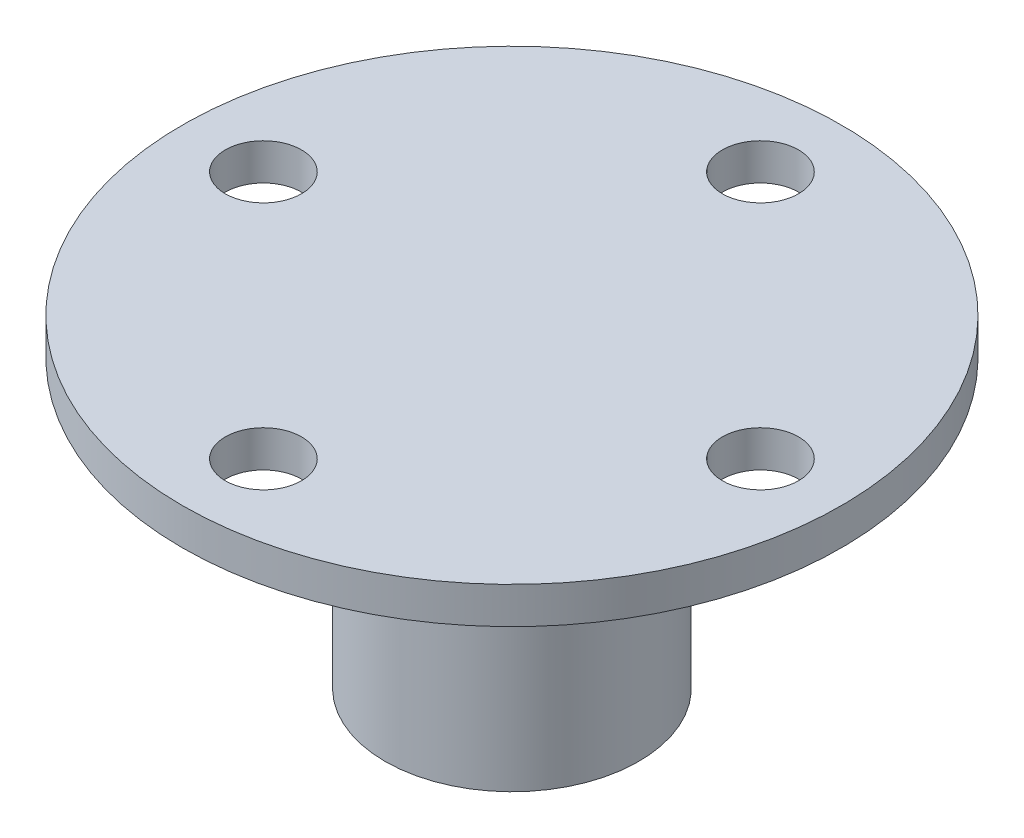
ISO-10303-21;
HEADER;
FILE_DESCRIPTION(('STEP AP214'),'2;1');
FILE_NAME('part.step','',(''),(''),'','','');
FILE_SCHEMA(('AUTOMOTIVE_DESIGN { 1 0 10303 214 1 1 1 1 }'));
ENDSEC;
DATA;
#1=APPLICATION_CONTEXT('core data for automotive mechanical design processes');
#2=APPLICATION_PROTOCOL_DEFINITION('international standard','automotive_design',2000,#1);
#3=PRODUCT_CONTEXT('',#1,'mechanical');
#4=PRODUCT('Part','Part','',(#3));
#5=PRODUCT_RELATED_PRODUCT_CATEGORY('part','',(#4));
#6=PRODUCT_DEFINITION_FORMATION('','',#4);
#7=PRODUCT_DEFINITION_CONTEXT('part definition',#1,'design');
#8=PRODUCT_DEFINITION('design','',#6,#7);
#9=PRODUCT_DEFINITION_SHAPE('','',#8);
#10=(LENGTH_UNIT() NAMED_UNIT(*) SI_UNIT(.MILLI.,.METRE.));
#11=(NAMED_UNIT(*) PLANE_ANGLE_UNIT() SI_UNIT($,.RADIAN.));
#12=(NAMED_UNIT(*) SI_UNIT($,.STERADIAN.) SOLID_ANGLE_UNIT());
#13=UNCERTAINTY_MEASURE_WITH_UNIT(LENGTH_MEASURE(1.E-05),#10,'distance_accuracy_value','');
#14=(GEOMETRIC_REPRESENTATION_CONTEXT(3) GLOBAL_UNCERTAINTY_ASSIGNED_CONTEXT((#13)) GLOBAL_UNIT_ASSIGNED_CONTEXT((#10,
#11,#12)) REPRESENTATION_CONTEXT('',''));
#15=CARTESIAN_POINT('',(0.,0.,0.));
#16=DIRECTION('',(0.,0.,1.));
#17=DIRECTION('',(1.,0.,0.));
#18=AXIS2_PLACEMENT_3D('',#15,#16,#17);
#19=CARTESIAN_POINT('',(0.,3.175,21.548));
#20=DIRECTION('',(0.,-1.,0.));
#21=DIRECTION('',(0.,0.,-1.));
#22=AXIS2_PLACEMENT_3D('',#19,#20,#21);
#23=CYLINDRICAL_SURFACE('',#22,3.302);
#24=CARTESIAN_POINT('',(0.,3.175,21.548));
#25=DIRECTION('',(0.,1.,0.));
#26=DIRECTION('',(0.,0.,1.));
#27=AXIS2_PLACEMENT_3D('',#24,#25,#26);
#28=CIRCLE('',#27,3.302);
#29=CARTESIAN_POINT('',(0.,3.175,24.85));
#30=VERTEX_POINT('',#29);
#31=EDGE_CURVE('E156',#30,#30,#28,.T.);
#32=ORIENTED_EDGE('',*,*,#31,.T.);
#33=EDGE_LOOP('',(#32));
#34=FACE_BOUND('',#33,.T.);
#35=CARTESIAN_POINT('',(0.,0.,21.548));
#36=DIRECTION('',(0.,1.,0.));
#37=DIRECTION('',(0.,0.,1.));
#38=AXIS2_PLACEMENT_3D('',#35,#36,#37);
#39=CIRCLE('',#38,3.302);
#40=CARTESIAN_POINT('',(0.,0.,24.85));
#41=VERTEX_POINT('',#40);
#42=EDGE_CURVE('E175',#41,#41,#39,.T.);
#43=ORIENTED_EDGE('',*,*,#42,.F.);
#44=EDGE_LOOP('',(#43));
#45=FACE_BOUND('',#44,.T.);
#46=ADVANCED_FACE('F47',(#34,#45),#23,.F.);
#47=CARTESIAN_POINT('',(-21.548,3.175,-1.50468879778784E-13));
#48=DIRECTION('',(0.,-1.,0.));
#49=DIRECTION('',(0.,0.,-1.));
#50=AXIS2_PLACEMENT_3D('',#47,#48,#49);
#51=CYLINDRICAL_SURFACE('',#50,3.302);
#52=CARTESIAN_POINT('',(-21.548,3.175,-1.50468879778784E-13));
#53=DIRECTION('',(0.,1.,0.));
#54=DIRECTION('',(0.,0.,1.));
#55=AXIS2_PLACEMENT_3D('',#52,#53,#54);
#56=CIRCLE('',#55,3.302);
#57=CARTESIAN_POINT('',(-21.548,3.175,3.30199999999985));
#58=VERTEX_POINT('',#57);
#59=EDGE_CURVE('E152',#58,#58,#56,.T.);
#60=ORIENTED_EDGE('',*,*,#59,.T.);
#61=EDGE_LOOP('',(#60));
#62=FACE_BOUND('',#61,.T.);
#63=CARTESIAN_POINT('',(-21.548,0.,-1.50468879778784E-13));
#64=DIRECTION('',(0.,1.,0.));
#65=DIRECTION('',(0.,0.,1.));
#66=AXIS2_PLACEMENT_3D('',#63,#64,#65);
#67=CIRCLE('',#66,3.302);
#68=CARTESIAN_POINT('',(-21.548,0.,3.30199999999985));
#69=VERTEX_POINT('',#68);
#70=EDGE_CURVE('E171',#69,#69,#67,.T.);
#71=ORIENTED_EDGE('',*,*,#70,.F.);
#72=EDGE_LOOP('',(#71));
#73=FACE_BOUND('',#72,.T.);
#74=ADVANCED_FACE('F198',(#62,#73),#51,.F.);
#75=CARTESIAN_POINT('',(2.25703319668175E-13,3.175,-21.548));
#76=DIRECTION('',(0.,-1.,0.));
#77=DIRECTION('',(0.,0.,-1.));
#78=AXIS2_PLACEMENT_3D('',#75,#76,#77);
#79=CYLINDRICAL_SURFACE('',#78,3.302);
#80=CARTESIAN_POINT('',(2.25703319668175E-13,3.175,-21.548));
#81=DIRECTION('',(0.,1.,0.));
#82=DIRECTION('',(0.,0.,1.));
#83=AXIS2_PLACEMENT_3D('',#80,#81,#82);
#84=CIRCLE('',#83,3.302);
#85=CARTESIAN_POINT('',(2.25703319668175E-13,3.175,-18.246));
#86=VERTEX_POINT('',#85);
#87=EDGE_CURVE('E147',#86,#86,#84,.T.);
#88=ORIENTED_EDGE('',*,*,#87,.T.);
#89=EDGE_LOOP('',(#88));
#90=FACE_BOUND('',#89,.T.);
#91=CARTESIAN_POINT('',(2.25703319668175E-13,0.,-21.548));
#92=DIRECTION('',(0.,1.,0.));
#93=DIRECTION('',(0.,0.,1.));
#94=AXIS2_PLACEMENT_3D('',#91,#92,#93);
#95=CIRCLE('',#94,3.302);
#96=CARTESIAN_POINT('',(2.25703319668175E-13,0.,-18.246));
#97=VERTEX_POINT('',#96);
#98=EDGE_CURVE('E167',#97,#97,#95,.T.);
#99=ORIENTED_EDGE('',*,*,#98,.F.);
#100=EDGE_LOOP('',(#99));
#101=FACE_BOUND('',#100,.T.);
#102=ADVANCED_FACE('F204',(#90,#101),#79,.F.);
#103=CARTESIAN_POINT('',(21.548,3.175,0.));
#104=DIRECTION('',(0.,-1.,0.));
#105=DIRECTION('',(0.,0.,-1.));
#106=AXIS2_PLACEMENT_3D('',#103,#104,#105);
#107=CYLINDRICAL_SURFACE('',#106,3.302);
#108=CARTESIAN_POINT('',(21.548,3.175,0.));
#109=DIRECTION('',(0.,1.,0.));
#110=DIRECTION('',(0.,0.,1.));
#111=AXIS2_PLACEMENT_3D('',#108,#109,#110);
#112=CIRCLE('',#111,3.302);
#113=CARTESIAN_POINT('',(21.548,3.175,3.302));
#114=VERTEX_POINT('',#113);
#115=EDGE_CURVE('E143',#114,#114,#112,.T.);
#116=ORIENTED_EDGE('',*,*,#115,.T.);
#117=EDGE_LOOP('',(#116));
#118=FACE_BOUND('',#117,.T.);
#119=CARTESIAN_POINT('',(21.548,0.,0.));
#120=DIRECTION('',(0.,1.,0.));
#121=DIRECTION('',(0.,0.,1.));
#122=AXIS2_PLACEMENT_3D('',#119,#120,#121);
#123=CIRCLE('',#122,3.302);
#124=CARTESIAN_POINT('',(21.548,0.,3.302));
#125=VERTEX_POINT('',#124);
#126=EDGE_CURVE('E137',#125,#125,#123,.T.);
#127=ORIENTED_EDGE('',*,*,#126,.F.);
#128=EDGE_LOOP('',(#127));
#129=FACE_BOUND('',#128,.T.);
#130=ADVANCED_FACE('F212',(#118,#129),#107,.F.);
#131=CARTESIAN_POINT('',(0.,3.175,0.));
#132=DIRECTION('',(0.,-1.,0.));
#133=DIRECTION('',(0.,0.,-1.));
#134=AXIS2_PLACEMENT_3D('',#131,#132,#133);
#135=CYLINDRICAL_SURFACE('',#134,28.575);
#136=CARTESIAN_POINT('',(0.,3.175,0.));
#137=DIRECTION('',(0.,1.,0.));
#138=DIRECTION('',(0.,0.,1.));
#139=AXIS2_PLACEMENT_3D('',#136,#137,#138);
#140=CIRCLE('',#139,28.575);
#141=CARTESIAN_POINT('',(0.,3.175,28.575));
#142=VERTEX_POINT('',#141);
#143=EDGE_CURVE('E160',#142,#142,#140,.T.);
#144=ORIENTED_EDGE('',*,*,#143,.F.);
#145=EDGE_LOOP('',(#144));
#146=FACE_BOUND('',#145,.T.);
#147=CARTESIAN_POINT('',(0.,0.,0.));
#148=DIRECTION('',(0.,1.,0.));
#149=DIRECTION('',(0.,0.,1.));
#150=AXIS2_PLACEMENT_3D('',#147,#148,#149);
#151=CIRCLE('',#150,28.575);
#152=CARTESIAN_POINT('',(0.,0.,28.575));
#153=VERTEX_POINT('',#152);
#154=EDGE_CURVE('E148',#153,#153,#151,.T.);
#155=ORIENTED_EDGE('',*,*,#154,.T.);
#156=EDGE_LOOP('',(#155));
#157=FACE_BOUND('',#156,.T.);
#158=ADVANCED_FACE('F209',(#146,#157),#135,.T.);
#159=CARTESIAN_POINT('',(0.,3.175,0.));
#160=DIRECTION('',(0.,1.,0.));
#161=DIRECTION('',(0.,0.,1.));
#162=AXIS2_PLACEMENT_3D('',#159,#160,#161);
#163=PLANE('',#162);
#164=ORIENTED_EDGE('',*,*,#115,.F.);
#165=EDGE_LOOP('',(#164));
#166=FACE_BOUND('',#165,.T.);
#167=ORIENTED_EDGE('',*,*,#87,.F.);
#168=EDGE_LOOP('',(#167));
#169=FACE_BOUND('',#168,.T.);
#170=ORIENTED_EDGE('',*,*,#59,.F.);
#171=EDGE_LOOP('',(#170));
#172=FACE_BOUND('',#171,.T.);
#173=ORIENTED_EDGE('',*,*,#31,.F.);
#174=EDGE_LOOP('',(#173));
#175=FACE_BOUND('',#174,.T.);
#176=ORIENTED_EDGE('',*,*,#143,.T.);
#177=EDGE_LOOP('',(#176));
#178=FACE_BOUND('',#177,.T.);
#179=ADVANCED_FACE('F219',(#166,#169,#172,#175,#178),#163,.T.);
#180=CARTESIAN_POINT('',(0.,0.,0.));
#181=DIRECTION('',(0.,1.,0.));
#182=DIRECTION('',(0.,0.,1.));
#183=AXIS2_PLACEMENT_3D('',#180,#181,#182);
#184=PLANE('',#183);
#185=CARTESIAN_POINT('',(0.,0.,0.));
#186=DIRECTION('',(0.,1.,0.));
#187=DIRECTION('',(0.,0.,1.));
#188=AXIS2_PLACEMENT_3D('',#185,#186,#187);
#189=CIRCLE('',#188,16.);
#190=CARTESIAN_POINT('',(0.,0.,16.));
#191=VERTEX_POINT('',#190);
#192=EDGE_CURVE('E56',#191,#191,#189,.T.);
#193=ORIENTED_EDGE('',*,*,#192,.T.);
#194=EDGE_LOOP('',(#193));
#195=FACE_BOUND('',#194,.T.);
#196=ORIENTED_EDGE('',*,*,#126,.T.);
#197=EDGE_LOOP('',(#196));
#198=FACE_BOUND('',#197,.T.);
#199=ORIENTED_EDGE('',*,*,#98,.T.);
#200=EDGE_LOOP('',(#199));
#201=FACE_BOUND('',#200,.T.);
#202=ORIENTED_EDGE('',*,*,#70,.T.);
#203=EDGE_LOOP('',(#202));
#204=FACE_BOUND('',#203,.T.);
#205=ORIENTED_EDGE('',*,*,#42,.T.);
#206=EDGE_LOOP('',(#205));
#207=FACE_BOUND('',#206,.T.);
#208=ORIENTED_EDGE('',*,*,#154,.F.);
#209=EDGE_LOOP('',(#208));
#210=FACE_BOUND('',#209,.T.);
#211=ADVANCED_FACE('F185',(#195,#198,#201,#204,#207,#210),#184,.F.);
#212=CARTESIAN_POINT('',(0.,-24.825,0.));
#213=DIRECTION('',(0.,1.,0.));
#214=DIRECTION('',(0.,0.,1.));
#215=AXIS2_PLACEMENT_3D('',#212,#213,#214);
#216=CYLINDRICAL_SURFACE('',#215,6.);
#217=CARTESIAN_POINT('',(0.,0.,0.));
#218=DIRECTION('',(0.,1.,0.));
#219=DIRECTION('',(0.,0.,1.));
#220=AXIS2_PLACEMENT_3D('',#217,#218,#219);
#221=CIRCLE('',#220,6.);
#222=CARTESIAN_POINT('',(-2.5857864376269,0.,5.4142135623731));
#223=VERTEX_POINT('',#222);
#224=CARTESIAN_POINT('',(-5.41421356237311,0.,2.58578643762691));
#225=VERTEX_POINT('',#224);
#226=EDGE_CURVE('E126',#223,#225,#221,.T.);
#227=ORIENTED_EDGE('',*,*,#226,.T.);
#228=DIRECTION('',(0.,1.,0.));
#229=VECTOR('',#228,1.);
#230=CARTESIAN_POINT('',(-5.41421356237311,-24.825,2.58578643762691));
#231=LINE('',#230,#229);
#232=CARTESIAN_POINT('',(-5.41421356237311,-24.825,2.58578643762691));
#233=VERTEX_POINT('',#232);
#234=EDGE_CURVE('E113',#233,#225,#231,.T.);
#235=ORIENTED_EDGE('',*,*,#234,.F.);
#236=CARTESIAN_POINT('',(0.,-24.825,0.));
#237=DIRECTION('',(0.,1.,0.));
#238=DIRECTION('',(0.,0.,1.));
#239=AXIS2_PLACEMENT_3D('',#236,#237,#238);
#240=CIRCLE('',#239,6.);
#241=CARTESIAN_POINT('',(-2.5857864376269,-24.825,5.4142135623731));
#242=VERTEX_POINT('',#241);
#243=EDGE_CURVE('E92',#242,#233,#240,.T.);
#244=ORIENTED_EDGE('',*,*,#243,.F.);
#245=DIRECTION('',(0.,1.,0.));
#246=VECTOR('',#245,1.);
#247=CARTESIAN_POINT('',(-2.5857864376269,-24.825,5.4142135623731));
#248=LINE('',#247,#246);
#249=EDGE_CURVE('E103',#242,#223,#248,.T.);
#250=ORIENTED_EDGE('',*,*,#249,.T.);
#251=EDGE_LOOP('',(#227,#235,#244,#250));
#252=FACE_BOUND('',#251,.T.);
#253=ADVANCED_FACE('F112',(#252),#216,.F.);
#254=CARTESIAN_POINT('',(-1.41421356237311,-24.825,-1.4142135623731));
#255=DIRECTION('',(0.707106781186548,0.,0.707106781186547));
#256=DIRECTION('',(0.707106781186547,0.,-0.707106781186548));
#257=AXIS2_PLACEMENT_3D('',#254,#255,#256);
#258=PLANE('',#257);
#259=DIRECTION('',(0.707106781186547,0.,-0.707106781186548));
#260=VECTOR('',#259,1.);
#261=CARTESIAN_POINT('',(-1.41421356237311,0.,-1.4142135623731));
#262=LINE('',#261,#260);
#263=CARTESIAN_POINT('',(-6.71751442127221,0.,3.88908729652601));
#264=VERTEX_POINT('',#263);
#265=EDGE_CURVE('E63',#264,#225,#262,.T.);
#266=ORIENTED_EDGE('',*,*,#265,.F.);
#267=DIRECTION('',(0.,1.,0.));
#268=VECTOR('',#267,1.);
#269=CARTESIAN_POINT('',(-6.71751442127221,-24.825,3.88908729652601));
#270=LINE('',#269,#268);
#271=CARTESIAN_POINT('',(-6.71751442127221,-24.825,3.88908729652601));
#272=VERTEX_POINT('',#271);
#273=EDGE_CURVE('E138',#272,#264,#270,.T.);
#274=ORIENTED_EDGE('',*,*,#273,.F.);
#275=DIRECTION('',(0.707106781186547,0.,-0.707106781186548));
#276=VECTOR('',#275,1.);
#277=CARTESIAN_POINT('',(-1.41421356237311,-24.825,-1.4142135623731));
#278=LINE('',#277,#276);
#279=EDGE_CURVE('E110',#272,#233,#278,.T.);
#280=ORIENTED_EDGE('',*,*,#279,.T.);
#281=ORIENTED_EDGE('',*,*,#234,.T.);
#282=EDGE_LOOP('',(#266,#274,#280,#281));
#283=FACE_BOUND('',#282,.T.);
#284=ADVANCED_FACE('F239',(#283),#258,.T.);
#285=CARTESIAN_POINT('',(-5.30330085889909,-24.825,5.30330085889912));
#286=DIRECTION('',(-0.707106781186546,0.,0.707106781186549));
#287=DIRECTION('',(0.707106781186549,0.,0.707106781186546));
#288=AXIS2_PLACEMENT_3D('',#285,#286,#287);
#289=PLANE('',#288);
#290=DIRECTION('',(0.707106781186549,0.,0.707106781186546));
#291=VECTOR('',#290,1.);
#292=CARTESIAN_POINT('',(-5.30330085889909,0.,5.30330085889912));
#293=LINE('',#292,#291);
#294=CARTESIAN_POINT('',(-3.88908729652601,0.,6.7175144212722));
#295=VERTEX_POINT('',#294);
#296=EDGE_CURVE('E68',#264,#295,#293,.T.);
#297=ORIENTED_EDGE('',*,*,#296,.T.);
#298=DIRECTION('',(0.,1.,0.));
#299=VECTOR('',#298,1.);
#300=CARTESIAN_POINT('',(-3.88908729652601,-24.825,6.7175144212722));
#301=LINE('',#300,#299);
#302=CARTESIAN_POINT('',(-3.88908729652601,-24.825,6.7175144212722));
#303=VERTEX_POINT('',#302);
#304=EDGE_CURVE('E109',#303,#295,#301,.T.);
#305=ORIENTED_EDGE('',*,*,#304,.F.);
#306=DIRECTION('',(0.707106781186549,0.,0.707106781186546));
#307=VECTOR('',#306,1.);
#308=CARTESIAN_POINT('',(-5.30330085889909,-24.825,5.30330085889912));
#309=LINE('',#308,#307);
#310=EDGE_CURVE('E95',#272,#303,#309,.T.);
#311=ORIENTED_EDGE('',*,*,#310,.F.);
#312=ORIENTED_EDGE('',*,*,#273,.T.);
#313=EDGE_LOOP('',(#297,#305,#311,#312));
#314=FACE_BOUND('',#313,.T.);
#315=ADVANCED_FACE('F246',(#314),#289,.F.);
#316=CARTESIAN_POINT('',(0.,-24.825,0.));
#317=DIRECTION('',(0.,1.,0.));
#318=DIRECTION('',(0.,0.,1.));
#319=AXIS2_PLACEMENT_3D('',#316,#317,#318);
#320=CYLINDRICAL_SURFACE('',#319,11.);
#321=CARTESIAN_POINT('',(0.,-5.,0.));
#322=DIRECTION('',(0.,1.,0.));
#323=DIRECTION('',(0.,0.,1.));
#324=AXIS2_PLACEMENT_3D('',#321,#322,#323);
#325=CIRCLE('',#324,11.);
#326=CARTESIAN_POINT('',(0.,-5.,11.));
#327=VERTEX_POINT('',#326);
#328=EDGE_CURVE('E11',#327,#327,#325,.F.);
#329=ORIENTED_EDGE('',*,*,#328,.T.);
#330=EDGE_LOOP('',(#329));
#331=FACE_BOUND('',#330,.T.);
#332=CARTESIAN_POINT('',(0.,-24.825,0.));
#333=DIRECTION('',(0.,1.,0.));
#334=DIRECTION('',(0.,0.,1.));
#335=AXIS2_PLACEMENT_3D('',#332,#333,#334);
#336=CIRCLE('',#335,11.);
#337=CARTESIAN_POINT('',(0.,-24.825,11.));
#338=VERTEX_POINT('',#337);
#339=EDGE_CURVE('E116',#338,#338,#336,.T.);
#340=ORIENTED_EDGE('',*,*,#339,.T.);
#341=EDGE_LOOP('',(#340));
#342=FACE_BOUND('',#341,.T.);
#343=ADVANCED_FACE('F245',(#331,#342),#320,.T.);
#344=CARTESIAN_POINT('',(1.4142135623731,-24.825,1.4142135623731));
#345=DIRECTION('',(0.707106781186547,0.,0.707106781186548));
#346=DIRECTION('',(0.707106781186548,0.,-0.707106781186547));
#347=AXIS2_PLACEMENT_3D('',#344,#345,#346);
#348=PLANE('',#347);
#349=DIRECTION('',(0.707106781186548,0.,-0.707106781186547));
#350=VECTOR('',#349,1.);
#351=CARTESIAN_POINT('',(1.4142135623731,0.,1.4142135623731));
#352=LINE('',#351,#350);
#353=EDGE_CURVE('E105',#295,#223,#352,.T.);
#354=ORIENTED_EDGE('',*,*,#353,.T.);
#355=ORIENTED_EDGE('',*,*,#249,.F.);
#356=DIRECTION('',(0.707106781186548,0.,-0.707106781186547));
#357=VECTOR('',#356,1.);
#358=CARTESIAN_POINT('',(1.4142135623731,-24.825,1.4142135623731));
#359=LINE('',#358,#357);
#360=EDGE_CURVE('E87',#303,#242,#359,.T.);
#361=ORIENTED_EDGE('',*,*,#360,.F.);
#362=ORIENTED_EDGE('',*,*,#304,.T.);
#363=EDGE_LOOP('',(#354,#355,#361,#362));
#364=FACE_BOUND('',#363,.T.);
#365=ADVANCED_FACE('F104',(#364),#348,.F.);
#366=CARTESIAN_POINT('',(0.,-24.825,0.));
#367=DIRECTION('',(0.,1.,0.));
#368=DIRECTION('',(0.,0.,1.));
#369=AXIS2_PLACEMENT_3D('',#366,#367,#368);
#370=PLANE('',#369);
#371=ORIENTED_EDGE('',*,*,#339,.F.);
#372=EDGE_LOOP('',(#371));
#373=FACE_BOUND('',#372,.T.);
#374=ORIENTED_EDGE('',*,*,#243,.T.);
#375=ORIENTED_EDGE('',*,*,#279,.F.);
#376=ORIENTED_EDGE('',*,*,#310,.T.);
#377=ORIENTED_EDGE('',*,*,#360,.T.);
#378=EDGE_LOOP('',(#374,#375,#376,#377));
#379=FACE_BOUND('',#378,.T.);
#380=ADVANCED_FACE('F89',(#373,#379),#370,.F.);
#381=ORIENTED_EDGE('',*,*,#226,.F.);
#382=ORIENTED_EDGE('',*,*,#353,.F.);
#383=ORIENTED_EDGE('',*,*,#296,.F.);
#384=ORIENTED_EDGE('',*,*,#265,.T.);
#385=EDGE_LOOP('',(#381,#382,#383,#384));
#386=FACE_BOUND('',#385,.T.);
#387=ADVANCED_FACE('F189',(#386),#184,.F.);
#388=CARTESIAN_POINT('',(0.,-5.,0.));
#389=DIRECTION('',(0.,1.,0.));
#390=DIRECTION('',(0.,0.,1.));
#391=AXIS2_PLACEMENT_3D('',#388,#389,#390);
#392=TOROIDAL_SURFACE('',#391,16.,5.);
#393=ORIENTED_EDGE('',*,*,#328,.F.);
#394=EDGE_LOOP('',(#393));
#395=FACE_BOUND('',#394,.T.);
#396=ORIENTED_EDGE('',*,*,#192,.F.);
#397=EDGE_LOOP('',(#396));
#398=FACE_BOUND('',#397,.T.);
#399=ADVANCED_FACE('F49',(#395,#398),#392,.F.);
#400=CLOSED_SHELL('',(#46,#74,#102,#130,#158,#179,#211,#253,#284,#315,#343,#365,#380,#387,#399));
#401=MANIFOLD_SOLID_BREP('B2',#400);
#402=ADVANCED_BREP_SHAPE_REPRESENTATION('',(#18,#401),#14);
#403=SHAPE_DEFINITION_REPRESENTATION(#9,#402);
ENDSEC;
END-ISO-10303-21;
